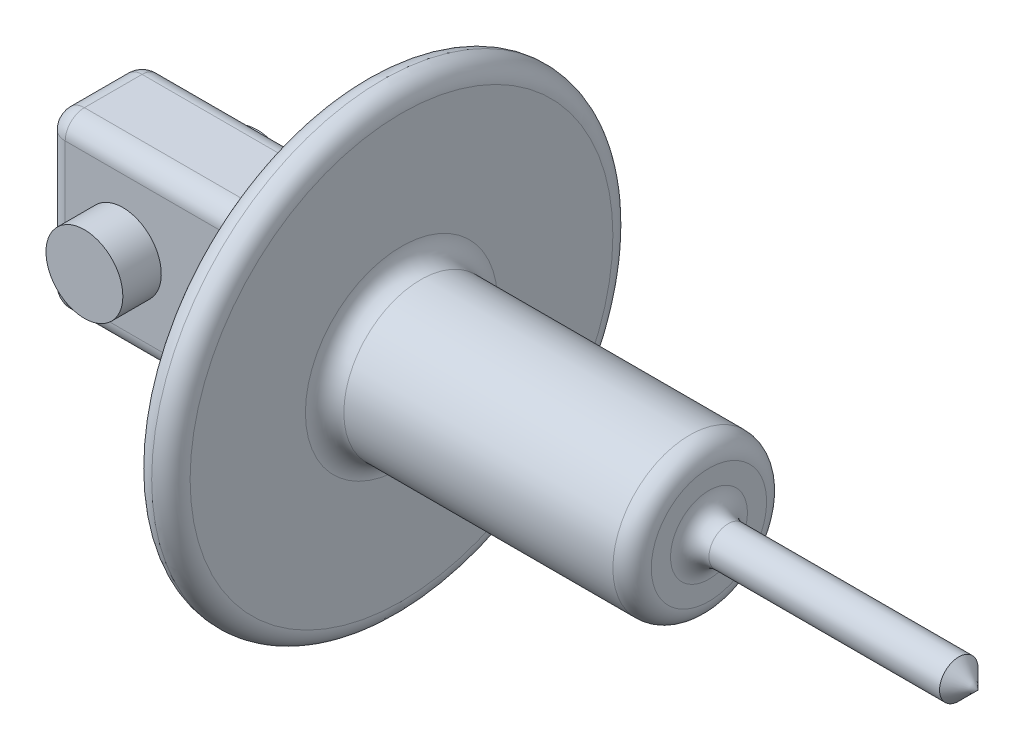
ISO-10303-21;
HEADER;
FILE_DESCRIPTION(('STEP AP214'),'2;1');
FILE_NAME('part.step','',(''),(''),'','','');
FILE_SCHEMA(('AUTOMOTIVE_DESIGN { 1 0 10303 214 1 1 1 1 }'));
ENDSEC;
DATA;
#1=APPLICATION_CONTEXT('core data for automotive mechanical design processes');
#2=APPLICATION_PROTOCOL_DEFINITION('international standard','automotive_design',2000,#1);
#3=PRODUCT_CONTEXT('',#1,'mechanical');
#4=PRODUCT('Part','Part','',(#3));
#5=PRODUCT_RELATED_PRODUCT_CATEGORY('part','',(#4));
#6=PRODUCT_DEFINITION_FORMATION('','',#4);
#7=PRODUCT_DEFINITION_CONTEXT('part definition',#1,'design');
#8=PRODUCT_DEFINITION('design','',#6,#7);
#9=PRODUCT_DEFINITION_SHAPE('','',#8);
#10=(LENGTH_UNIT() NAMED_UNIT(*) SI_UNIT(.MILLI.,.METRE.));
#11=(NAMED_UNIT(*) PLANE_ANGLE_UNIT() SI_UNIT($,.RADIAN.));
#12=(NAMED_UNIT(*) SI_UNIT($,.STERADIAN.) SOLID_ANGLE_UNIT());
#13=UNCERTAINTY_MEASURE_WITH_UNIT(LENGTH_MEASURE(1.E-05),#10,'distance_accuracy_value','');
#14=(GEOMETRIC_REPRESENTATION_CONTEXT(3) GLOBAL_UNCERTAINTY_ASSIGNED_CONTEXT((#13)) GLOBAL_UNIT_ASSIGNED_CONTEXT((#10,
#11,#12)) REPRESENTATION_CONTEXT('',''));
#15=CARTESIAN_POINT('',(0.,0.,0.));
#16=DIRECTION('',(0.,0.,1.));
#17=DIRECTION('',(1.,0.,0.));
#18=AXIS2_PLACEMENT_3D('',#15,#16,#17);
#19=CARTESIAN_POINT('',(50.,1.89429388422407E-13,0.));
#20=DIRECTION('',(-1.,0.,0.));
#21=DIRECTION('',(0.,0.,1.));
#22=AXIS2_PLACEMENT_3D('',#19,#20,#21);
#23=PLANE('',#22);
#24=CARTESIAN_POINT('',(50.,1.89429388422407E-13,0.));
#25=DIRECTION('',(-1.,0.,0.));
#26=DIRECTION('',(0.,0.,1.));
#27=AXIS2_PLACEMENT_3D('',#24,#25,#26);
#28=CIRCLE('',#27,55.);
#29=CARTESIAN_POINT('',(50.,5.73492335695152E-13,55.));
#30=VERTEX_POINT('',#29);
#31=EDGE_CURVE('E184',#30,#30,#28,.T.);
#32=ORIENTED_EDGE('',*,*,#31,.T.);
#33=EDGE_LOOP('',(#32));
#34=FACE_BOUND('',#33,.T.);
#35=CARTESIAN_POINT('',(49.9999999999999,17.5000000000002,7.49999999999985));
#36=DIRECTION('',(-1.,0.,0.));
#37=DIRECTION('',(0.,0.,1.));
#38=AXIS2_PLACEMENT_3D('',#35,#36,#37);
#39=CIRCLE('',#38,10.);
#40=CARTESIAN_POINT('',(49.9999999999999,17.5000000000003,17.4999999999999));
#41=VERTEX_POINT('',#40);
#42=CARTESIAN_POINT('',(49.9999999999998,27.5000000000002,7.49999999999978));
#43=VERTEX_POINT('',#42);
#44=EDGE_CURVE('E181',#41,#43,#39,.T.);
#45=ORIENTED_EDGE('',*,*,#44,.F.);
#46=DIRECTION('',(0.,-1.,0.));
#47=VECTOR('',#46,1.);
#48=CARTESIAN_POINT('',(50.0000000000002,-22.4999999999997,17.5000000000001));
#49=LINE('',#48,#47);
#50=CARTESIAN_POINT('',(50.0000000000001,-17.4999999999997,17.5000000000001));
#51=VERTEX_POINT('',#50);
#52=EDGE_CURVE('E178',#41,#51,#49,.T.);
#53=ORIENTED_EDGE('',*,*,#52,.T.);
#54=CARTESIAN_POINT('',(50.0000000000001,-17.4999999999998,7.5000000000001));
#55=DIRECTION('',(-1.,0.,0.));
#56=DIRECTION('',(0.,0.,1.));
#57=AXIS2_PLACEMENT_3D('',#54,#55,#56);
#58=CIRCLE('',#57,10.);
#59=CARTESIAN_POINT('',(50.0000000000002,-27.4999999999998,7.50000000000017));
#60=VERTEX_POINT('',#59);
#61=EDGE_CURVE('E175',#60,#51,#58,.T.);
#62=ORIENTED_EDGE('',*,*,#61,.F.);
#63=DIRECTION('',(0.,0.,1.));
#64=VECTOR('',#63,1.);
#65=CARTESIAN_POINT('',(50.0000000000002,-27.4999999999998,1.64275898020743E-13));
#66=LINE('',#65,#64);
#67=CARTESIAN_POINT('',(50.0000000000002,-27.4999999999999,-7.49999999999983));
#68=VERTEX_POINT('',#67);
#69=EDGE_CURVE('E171',#60,#68,#66,.F.);
#70=ORIENTED_EDGE('',*,*,#69,.T.);
#71=CARTESIAN_POINT('',(50.0000000000001,-17.4999999999999,-7.4999999999999));
#72=DIRECTION('',(-1.,0.,0.));
#73=DIRECTION('',(0.,0.,1.));
#74=AXIS2_PLACEMENT_3D('',#71,#72,#73);
#75=CIRCLE('',#74,10.);
#76=CARTESIAN_POINT('',(50.0000000000001,-17.4999999999999,-17.4999999999999));
#77=VERTEX_POINT('',#76);
#78=EDGE_CURVE('E168',#77,#68,#75,.T.);
#79=ORIENTED_EDGE('',*,*,#78,.F.);
#80=DIRECTION('',(0.,-1.,0.));
#81=VECTOR('',#80,1.);
#82=CARTESIAN_POINT('',(50.,0.,-17.5));
#83=LINE('',#82,#81);
#84=CARTESIAN_POINT('',(49.9999999999999,17.5000000000001,-17.5000000000001));
#85=VERTEX_POINT('',#84);
#86=EDGE_CURVE('E160',#77,#85,#83,.F.);
#87=ORIENTED_EDGE('',*,*,#86,.T.);
#88=CARTESIAN_POINT('',(49.9999999999999,17.5000000000001,-7.50000000000015));
#89=DIRECTION('',(-1.,0.,0.));
#90=DIRECTION('',(0.,0.,1.));
#91=AXIS2_PLACEMENT_3D('',#88,#89,#90);
#92=CIRCLE('',#91,10.);
#93=CARTESIAN_POINT('',(49.9999999999998,27.5000000000001,-7.50000000000022));
#94=VERTEX_POINT('',#93);
#95=EDGE_CURVE('E156',#94,#85,#92,.T.);
#96=ORIENTED_EDGE('',*,*,#95,.F.);
#97=DIRECTION('',(0.,0.,1.));
#98=VECTOR('',#97,1.);
#99=CARTESIAN_POINT('',(49.9999999999998,27.5000000000003,12.4999999999998));
#100=LINE('',#99,#98);
#101=EDGE_CURVE('E173',#94,#43,#100,.T.);
#102=ORIENTED_EDGE('',*,*,#101,.T.);
#103=EDGE_LOOP('',(#45,#53,#62,#70,#79,#87,#96,#102));
#104=FACE_BOUND('',#103,.T.);
#105=ADVANCED_FACE('F40',(#34,#104),#23,.T.);
#106=CARTESIAN_POINT('',(60.,2.5925901519927E-13,0.));
#107=DIRECTION('',(-1.,0.,0.));
#108=DIRECTION('',(0.,0.,1.));
#109=AXIS2_PLACEMENT_3D('',#106,#107,#108);
#110=PLANE('',#109);
#111=CARTESIAN_POINT('',(60.,2.5925901519927E-13,0.));
#112=DIRECTION('',(-1.,0.,0.));
#113=DIRECTION('',(0.,0.,1.));
#114=AXIS2_PLACEMENT_3D('',#111,#112,#113);
#115=CIRCLE('',#114,25.);
#116=CARTESIAN_POINT('',(60.,4.33833082141426E-13,25.));
#117=VERTEX_POINT('',#116);
#118=EDGE_CURVE('E217',#117,#117,#115,.T.);
#119=ORIENTED_EDGE('',*,*,#118,.T.);
#120=EDGE_LOOP('',(#119));
#121=FACE_BOUND('',#120,.T.);
#122=CARTESIAN_POINT('',(60.,2.5925901519927E-13,0.));
#123=DIRECTION('',(-1.,0.,0.));
#124=DIRECTION('',(0.,0.,1.));
#125=AXIS2_PLACEMENT_3D('',#122,#123,#124);
#126=CIRCLE('',#125,55.);
#127=CARTESIAN_POINT('',(60.,6.43321962472014E-13,55.));
#128=VERTEX_POINT('',#127);
#129=EDGE_CURVE('E214',#128,#128,#126,.F.);
#130=ORIENTED_EDGE('',*,*,#129,.T.);
#131=EDGE_LOOP('',(#130));
#132=FACE_BOUND('',#131,.T.);
#133=ADVANCED_FACE('F345',(#121,#132),#110,.F.);
#134=CARTESIAN_POINT('',(140.,8.17896029414171E-13,0.));
#135=DIRECTION('',(-1.,0.,0.));
#136=DIRECTION('',(0.,0.,1.));
#137=AXIS2_PLACEMENT_3D('',#134,#135,#136);
#138=CYLINDRICAL_SURFACE('',#137,20.);
#139=CARTESIAN_POINT('',(65.,2.94173828587701E-13,0.));
#140=DIRECTION('',(-1.,0.,0.));
#141=DIRECTION('',(0.,0.,1.));
#142=AXIS2_PLACEMENT_3D('',#139,#140,#141);
#143=CIRCLE('',#142,20.);
#144=CARTESIAN_POINT('',(65.,4.33833082141427E-13,20.));
#145=VERTEX_POINT('',#144);
#146=EDGE_CURVE('E223',#145,#145,#143,.F.);
#147=ORIENTED_EDGE('',*,*,#146,.T.);
#148=EDGE_LOOP('',(#147));
#149=FACE_BOUND('',#148,.T.);
#150=CARTESIAN_POINT('',(135.,7.8298121602574E-13,0.));
#151=DIRECTION('',(-1.,0.,0.));
#152=DIRECTION('',(0.,0.,1.));
#153=AXIS2_PLACEMENT_3D('',#150,#151,#152);
#154=CIRCLE('',#153,20.);
#155=CARTESIAN_POINT('',(135.,9.22640469579465E-13,20.));
#156=VERTEX_POINT('',#155);
#157=EDGE_CURVE('E220',#156,#156,#154,.T.);
#158=ORIENTED_EDGE('',*,*,#157,.T.);
#159=EDGE_LOOP('',(#158));
#160=FACE_BOUND('',#159,.T.);
#161=ADVANCED_FACE('F351',(#149,#160),#138,.T.);
#162=CARTESIAN_POINT('',(140.,8.17896029414171E-13,0.));
#163=DIRECTION('',(-1.,0.,0.));
#164=DIRECTION('',(0.,0.,1.));
#165=AXIS2_PLACEMENT_3D('',#162,#163,#164);
#166=PLANE('',#165);
#167=CARTESIAN_POINT('',(140.,8.17896029414171E-13,0.));
#168=DIRECTION('',(-1.,0.,0.));
#169=DIRECTION('',(0.,0.,1.));
#170=AXIS2_PLACEMENT_3D('',#167,#168,#169);
#171=CIRCLE('',#170,10.);
#172=CARTESIAN_POINT('',(140.,8.87725656191034E-13,9.99999999999997));
#173=VERTEX_POINT('',#172);
#174=EDGE_CURVE('E229',#173,#173,#171,.T.);
#175=ORIENTED_EDGE('',*,*,#174,.T.);
#176=EDGE_LOOP('',(#175));
#177=FACE_BOUND('',#176,.T.);
#178=CARTESIAN_POINT('',(140.,8.17896029414171E-13,0.));
#179=DIRECTION('',(-1.,0.,0.));
#180=DIRECTION('',(0.,0.,1.));
#181=AXIS2_PLACEMENT_3D('',#178,#179,#180);
#182=CIRCLE('',#181,15.);
#183=CARTESIAN_POINT('',(140.,9.22640469579465E-13,15.));
#184=VERTEX_POINT('',#183);
#185=EDGE_CURVE('E226',#184,#184,#182,.F.);
#186=ORIENTED_EDGE('',*,*,#185,.T.);
#187=EDGE_LOOP('',(#186));
#188=FACE_BOUND('',#187,.T.);
#189=ADVANCED_FACE('F670',(#177,#188),#166,.F.);
#190=CARTESIAN_POINT('',(210.,1.30670341685221E-12,0.));
#191=DIRECTION('',(-1.,0.,0.));
#192=DIRECTION('',(0.,0.,1.));
#193=AXIS2_PLACEMENT_3D('',#190,#191,#192);
#194=CYLINDRICAL_SURFACE('',#193,5.);
#195=CARTESIAN_POINT('',(145.,8.52810842802602E-13,0.));
#196=DIRECTION('',(-1.,0.,0.));
#197=DIRECTION('',(0.,0.,1.));
#198=AXIS2_PLACEMENT_3D('',#195,#196,#197);
#199=CIRCLE('',#198,5.);
#200=CARTESIAN_POINT('',(145.,8.87725656191034E-13,4.99999999999997));
#201=VERTEX_POINT('',#200);
#202=EDGE_CURVE('E232',#201,#201,#199,.F.);
#203=ORIENTED_EDGE('',*,*,#202,.T.);
#204=EDGE_LOOP('',(#203));
#205=FACE_BOUND('',#204,.T.);
#206=CARTESIAN_POINT('',(205.,1.27178860346378E-12,0.));
#207=DIRECTION('',(-1.,0.,0.));
#208=DIRECTION('',(0.,0.,1.));
#209=AXIS2_PLACEMENT_3D('',#206,#207,#208);
#210=CIRCLE('',#209,5.);
#211=CARTESIAN_POINT('',(205.,1.30670341685221E-12,4.99999999999997));
#212=VERTEX_POINT('',#211);
#213=EDGE_CURVE('E154',#212,#212,#210,.T.);
#214=ORIENTED_EDGE('',*,*,#213,.T.);
#215=EDGE_LOOP('',(#214));
#216=FACE_BOUND('',#215,.T.);
#217=ADVANCED_FACE('F150',(#205,#216),#194,.T.);
#218=CARTESIAN_POINT('',(205.,1.27178860346378E-12,0.));
#219=DIRECTION('',(-1.,0.,0.));
#220=DIRECTION('',(0.,0.,1.));
#221=AXIS2_PLACEMENT_3D('',#218,#219,#220);
#222=CONICAL_SURFACE('',#221,4.99999999999997,0.785398163397451);
#223=CARTESIAN_POINT('',(210.,1.30670341685221E-12,0.));
#224=VERTEX_POINT('',#223);
#225=VERTEX_LOOP('',#224);
#226=FACE_BOUND('',#225,.T.);
#227=ORIENTED_EDGE('',*,*,#213,.F.);
#228=EDGE_LOOP('',(#227));
#229=FACE_BOUND('',#228,.T.);
#230=ADVANCED_FACE('F146',(#226,#229),#222,.T.);
#231=CARTESIAN_POINT('',(-20.0000000000002,22.4999999999996,-12.5000000000002));
#232=DIRECTION('',(0.,0.,1.));
#233=DIRECTION('',(0.,1.,0.));
#234=AXIS2_PLACEMENT_3D('',#231,#232,#233);
#235=PLANE('',#234);
#236=DIRECTION('',(1.,0.,0.));
#237=VECTOR('',#236,1.);
#238=CARTESIAN_POINT('',(49.9999999999999,17.5000000000001,-12.5000000000001));
#239=LINE('',#238,#237);
#240=CARTESIAN_POINT('',(-15.0000000000001,17.4999999999996,-12.5000000000001));
#241=VERTEX_POINT('',#240);
#242=CARTESIAN_POINT('',(44.9999999999999,17.5000000000001,-12.5000000000001));
#243=VERTEX_POINT('',#242);
#244=EDGE_CURVE('E235',#241,#243,#239,.T.);
#245=ORIENTED_EDGE('',*,*,#244,.T.);
#246=DIRECTION('',(0.,-1.,0.));
#247=VECTOR('',#246,1.);
#248=CARTESIAN_POINT('',(44.9999999999998,22.5000000000001,-12.5000000000002));
#249=LINE('',#248,#247);
#250=CARTESIAN_POINT('',(45.0000000000001,-17.4999999999999,-12.4999999999999));
#251=VERTEX_POINT('',#250);
#252=EDGE_CURVE('E241',#243,#251,#249,.T.);
#253=ORIENTED_EDGE('',*,*,#252,.T.);
#254=DIRECTION('',(1.,0.,0.));
#255=VECTOR('',#254,1.);
#256=CARTESIAN_POINT('',(-19.9999999999999,-17.5000000000004,-12.4999999999999));
#257=LINE('',#256,#255);
#258=CARTESIAN_POINT('',(-14.9999999999999,-17.5000000000004,-12.4999999999999));
#259=VERTEX_POINT('',#258);
#260=EDGE_CURVE('E239',#251,#259,#257,.F.);
#261=ORIENTED_EDGE('',*,*,#260,.T.);
#262=DIRECTION('',(0.,-1.,0.));
#263=VECTOR('',#262,1.);
#264=CARTESIAN_POINT('',(-15.0000000000002,22.4999999999996,-12.5000000000002));
#265=LINE('',#264,#263);
#266=EDGE_CURVE('E237',#259,#241,#265,.F.);
#267=ORIENTED_EDGE('',*,*,#266,.T.);
#268=EDGE_LOOP('',(#245,#253,#261,#267));
#269=FACE_BOUND('',#268,.T.);
#270=CARTESIAN_POINT('',(0.,-2.45560176036337E-13,-12.5));
#271=DIRECTION('',(0.,0.,1.));
#272=DIRECTION('',(0.,1.,0.));
#273=AXIS2_PLACEMENT_3D('',#270,#271,#272);
#274=CIRCLE('',#273,10.);
#275=CARTESIAN_POINT('',(0.,9.99999999999975,-12.5000000000001));
#276=VERTEX_POINT('',#275);
#277=EDGE_CURVE('E310',#276,#276,#274,.T.);
#278=ORIENTED_EDGE('',*,*,#277,.T.);
#279=EDGE_LOOP('',(#278));
#280=FACE_BOUND('',#279,.T.);
#281=ADVANCED_FACE('F149',(#269,#280),#235,.F.);
#282=CARTESIAN_POINT('',(-19.9999999999999,-22.5000000000004,-12.4999999999999));
#283=DIRECTION('',(0.,1.,0.));
#284=DIRECTION('',(0.,0.,-1.));
#285=AXIS2_PLACEMENT_3D('',#282,#283,#284);
#286=PLANE('',#285);
#287=DIRECTION('',(1.,0.,0.));
#288=VECTOR('',#287,1.);
#289=CARTESIAN_POINT('',(-19.9999999999999,-22.5000000000004,-7.49999999999987));
#290=LINE('',#289,#288);
#291=CARTESIAN_POINT('',(-14.9999999999998,-22.5000000000003,-7.49999999999987));
#292=VERTEX_POINT('',#291);
#293=CARTESIAN_POINT('',(45.0000000000001,-22.4999999999999,-7.49999999999987));
#294=VERTEX_POINT('',#293);
#295=EDGE_CURVE('E207',#292,#294,#290,.T.);
#296=ORIENTED_EDGE('',*,*,#295,.T.);
#297=DIRECTION('',(0.,0.,1.));
#298=VECTOR('',#297,1.);
#299=CARTESIAN_POINT('',(45.0000000000001,-22.4999999999999,-12.4999999999999));
#300=LINE('',#299,#298);
#301=CARTESIAN_POINT('',(45.0000000000001,-22.4999999999998,7.50000000000013));
#302=VERTEX_POINT('',#301);
#303=EDGE_CURVE('E211',#294,#302,#300,.T.);
#304=ORIENTED_EDGE('',*,*,#303,.T.);
#305=DIRECTION('',(1.,0.,0.));
#306=VECTOR('',#305,1.);
#307=CARTESIAN_POINT('',(-19.9999999999999,-22.5000000000003,7.50000000000013));
#308=LINE('',#307,#306);
#309=CARTESIAN_POINT('',(-14.9999999999998,-22.5000000000002,7.50000000000013));
#310=VERTEX_POINT('',#309);
#311=EDGE_CURVE('E209',#302,#310,#308,.F.);
#312=ORIENTED_EDGE('',*,*,#311,.T.);
#313=DIRECTION('',(0.,0.,1.));
#314=VECTOR('',#313,1.);
#315=CARTESIAN_POINT('',(-14.9999999999998,-22.5000000000004,-12.4999999999999));
#316=LINE('',#315,#314);
#317=EDGE_CURVE('E205',#310,#292,#316,.F.);
#318=ORIENTED_EDGE('',*,*,#317,.T.);
#319=EDGE_LOOP('',(#296,#304,#312,#318));
#320=FACE_BOUND('',#319,.T.);
#321=ADVANCED_FACE('F332',(#320),#286,.F.);
#322=CARTESIAN_POINT('',(-20.0000000000002,22.4999999999998,12.4999999999998));
#323=DIRECTION('',(0.,0.,1.));
#324=DIRECTION('',(0.,1.,0.));
#325=AXIS2_PLACEMENT_3D('',#322,#323,#324);
#326=PLANE('',#325);
#327=DIRECTION('',(1.,0.,0.));
#328=VECTOR('',#327,1.);
#329=CARTESIAN_POINT('',(50.0000000000001,-17.4999999999997,12.5000000000001));
#330=LINE('',#329,#328);
#331=CARTESIAN_POINT('',(-14.9999999999999,-17.5000000000002,12.5000000000001));
#332=VERTEX_POINT('',#331);
#333=CARTESIAN_POINT('',(45.0000000000001,-17.4999999999998,12.5000000000001));
#334=VERTEX_POINT('',#333);
#335=EDGE_CURVE('E191',#332,#334,#330,.T.);
#336=ORIENTED_EDGE('',*,*,#335,.T.);
#337=DIRECTION('',(0.,-1.,0.));
#338=VECTOR('',#337,1.);
#339=CARTESIAN_POINT('',(44.9999999999998,22.5000000000002,12.4999999999998));
#340=LINE('',#339,#338);
#341=CARTESIAN_POINT('',(44.9999999999999,17.5000000000002,12.4999999999999));
#342=VERTEX_POINT('',#341);
#343=EDGE_CURVE('E193',#334,#342,#340,.F.);
#344=ORIENTED_EDGE('',*,*,#343,.T.);
#345=DIRECTION('',(1.,0.,0.));
#346=VECTOR('',#345,1.);
#347=CARTESIAN_POINT('',(-20.0000000000001,17.4999999999998,12.4999999999999));
#348=LINE('',#347,#346);
#349=CARTESIAN_POINT('',(-15.0000000000001,17.4999999999998,12.4999999999999));
#350=VERTEX_POINT('',#349);
#351=EDGE_CURVE('E187',#342,#350,#348,.F.);
#352=ORIENTED_EDGE('',*,*,#351,.T.);
#353=DIRECTION('',(0.,-1.,0.));
#354=VECTOR('',#353,1.);
#355=CARTESIAN_POINT('',(-15.0000000000002,22.4999999999998,12.4999999999998));
#356=LINE('',#355,#354);
#357=EDGE_CURVE('E189',#350,#332,#356,.T.);
#358=ORIENTED_EDGE('',*,*,#357,.T.);
#359=EDGE_LOOP('',(#336,#344,#352,#358));
#360=FACE_BOUND('',#359,.T.);
#361=CARTESIAN_POINT('',(0.,0.,12.5));
#362=DIRECTION('',(0.,0.,1.));
#363=DIRECTION('',(0.,1.,0.));
#364=AXIS2_PLACEMENT_3D('',#361,#362,#363);
#365=CIRCLE('',#364,10.);
#366=CARTESIAN_POINT('',(0.,9.99999999999993,12.4999999999999));
#367=VERTEX_POINT('',#366);
#368=EDGE_CURVE('E163',#367,#367,#365,.T.);
#369=ORIENTED_EDGE('',*,*,#368,.F.);
#370=EDGE_LOOP('',(#369));
#371=FACE_BOUND('',#370,.T.);
#372=ADVANCED_FACE('F329',(#360,#371),#326,.T.);
#373=CARTESIAN_POINT('',(-20.0000000000002,22.4999999999996,-12.5000000000002));
#374=DIRECTION('',(0.,1.,0.));
#375=DIRECTION('',(0.,0.,-1.));
#376=AXIS2_PLACEMENT_3D('',#373,#374,#375);
#377=PLANE('',#376);
#378=DIRECTION('',(1.,0.,0.));
#379=VECTOR('',#378,1.);
#380=CARTESIAN_POINT('',(-20.0000000000002,22.4999999999997,7.49999999999982));
#381=LINE('',#380,#379);
#382=CARTESIAN_POINT('',(-15.0000000000002,22.4999999999998,7.49999999999982));
#383=VERTEX_POINT('',#382);
#384=CARTESIAN_POINT('',(44.9999999999998,22.5000000000002,7.49999999999982));
#385=VERTEX_POINT('',#384);
#386=EDGE_CURVE('E200',#383,#385,#381,.T.);
#387=ORIENTED_EDGE('',*,*,#386,.T.);
#388=DIRECTION('',(0.,0.,1.));
#389=VECTOR('',#388,1.);
#390=CARTESIAN_POINT('',(44.9999999999998,22.5000000000001,-12.5000000000002));
#391=LINE('',#390,#389);
#392=CARTESIAN_POINT('',(44.9999999999998,22.5000000000001,-7.50000000000018));
#393=VERTEX_POINT('',#392);
#394=EDGE_CURVE('E202',#385,#393,#391,.F.);
#395=ORIENTED_EDGE('',*,*,#394,.T.);
#396=DIRECTION('',(1.,0.,0.));
#397=VECTOR('',#396,1.);
#398=CARTESIAN_POINT('',(-20.0000000000002,22.4999999999996,-7.50000000000018));
#399=LINE('',#398,#397);
#400=CARTESIAN_POINT('',(-15.0000000000002,22.4999999999997,-7.50000000000018));
#401=VERTEX_POINT('',#400);
#402=EDGE_CURVE('E196',#393,#401,#399,.F.);
#403=ORIENTED_EDGE('',*,*,#402,.T.);
#404=DIRECTION('',(0.,0.,1.));
#405=VECTOR('',#404,1.);
#406=CARTESIAN_POINT('',(-15.0000000000002,22.4999999999996,-12.5000000000002));
#407=LINE('',#406,#405);
#408=EDGE_CURVE('E198',#401,#383,#407,.T.);
#409=ORIENTED_EDGE('',*,*,#408,.T.);
#410=EDGE_LOOP('',(#387,#395,#403,#409));
#411=FACE_BOUND('',#410,.T.);
#412=ADVANCED_FACE('F331',(#411),#377,.T.);
#413=CARTESIAN_POINT('',(-20.,-2.99377999015632E-13,0.));
#414=DIRECTION('',(-1.,0.,0.));
#415=DIRECTION('',(0.,0.,1.));
#416=AXIS2_PLACEMENT_3D('',#413,#414,#415);
#417=PLANE('',#416);
#418=DIRECTION('',(0.,-1.,0.));
#419=VECTOR('',#418,1.);
#420=CARTESIAN_POINT('',(-19.9999999999999,-22.5000000000004,-7.49999999999987));
#421=LINE('',#420,#419);
#422=CARTESIAN_POINT('',(-20.0000000000001,17.4999999999996,-7.50000000000015));
#423=VERTEX_POINT('',#422);
#424=CARTESIAN_POINT('',(-19.9999999999999,-17.5000000000004,-7.4999999999999));
#425=VERTEX_POINT('',#424);
#426=EDGE_CURVE('E64',#423,#425,#421,.T.);
#427=ORIENTED_EDGE('',*,*,#426,.T.);
#428=DIRECTION('',(0.,0.,1.));
#429=VECTOR('',#428,1.);
#430=CARTESIAN_POINT('',(-19.9999999999999,-17.5000000000002,12.5000000000001));
#431=LINE('',#430,#429);
#432=CARTESIAN_POINT('',(-19.9999999999999,-17.5000000000003,7.5000000000001));
#433=VERTEX_POINT('',#432);
#434=EDGE_CURVE('E11',#425,#433,#431,.T.);
#435=ORIENTED_EDGE('',*,*,#434,.T.);
#436=DIRECTION('',(0.,-1.,0.));
#437=VECTOR('',#436,1.);
#438=CARTESIAN_POINT('',(-20.,-2.46138417194996E-13,7.49999999999998));
#439=LINE('',#438,#437);
#440=CARTESIAN_POINT('',(-20.0000000000001,17.4999999999997,7.49999999999985));
#441=VERTEX_POINT('',#440);
#442=EDGE_CURVE('E49',#433,#441,#439,.F.);
#443=ORIENTED_EDGE('',*,*,#442,.T.);
#444=DIRECTION('',(0.,0.,1.));
#445=VECTOR('',#444,1.);
#446=CARTESIAN_POINT('',(-20.0000000000001,17.4999999999997,-1.49957422475139E-13));
#447=LINE('',#446,#445);
#448=EDGE_CURVE('E244',#441,#423,#447,.F.);
#449=ORIENTED_EDGE('',*,*,#448,.T.);
#450=EDGE_LOOP('',(#427,#435,#443,#449));
#451=FACE_BOUND('',#450,.T.);
#452=ADVANCED_FACE('F339',(#451),#417,.T.);
#453=CARTESIAN_POINT('',(0.,0.,22.5));
#454=DIRECTION('',(0.,0.,-1.));
#455=DIRECTION('',(0.,-1.,0.));
#456=AXIS2_PLACEMENT_3D('',#453,#454,#455);
#457=CYLINDRICAL_SURFACE('',#456,10.);
#458=CARTESIAN_POINT('',(0.,0.,22.5));
#459=DIRECTION('',(0.,0.,1.));
#460=DIRECTION('',(0.,1.,0.));
#461=AXIS2_PLACEMENT_3D('',#458,#459,#460);
#462=CIRCLE('',#461,10.);
#463=CARTESIAN_POINT('',(0.,10.,22.4999999999999));
#464=VERTEX_POINT('',#463);
#465=EDGE_CURVE('E157',#464,#464,#462,.T.);
#466=ORIENTED_EDGE('',*,*,#465,.F.);
#467=EDGE_LOOP('',(#466));
#468=FACE_BOUND('',#467,.T.);
#469=ORIENTED_EDGE('',*,*,#368,.T.);
#470=EDGE_LOOP('',(#469));
#471=FACE_BOUND('',#470,.T.);
#472=ADVANCED_FACE('F327',(#468,#471),#457,.T.);
#473=CARTESIAN_POINT('',(0.,0.,22.5));
#474=DIRECTION('',(0.,0.,1.));
#475=DIRECTION('',(0.,1.,0.));
#476=AXIS2_PLACEMENT_3D('',#473,#474,#475);
#477=PLANE('',#476);
#478=ORIENTED_EDGE('',*,*,#465,.T.);
#479=EDGE_LOOP('',(#478));
#480=FACE_BOUND('',#479,.T.);
#481=ADVANCED_FACE('F596',(#480),#477,.T.);
#482=CARTESIAN_POINT('',(0.,-3.14233320495882E-13,-22.5));
#483=DIRECTION('',(0.,0.,1.));
#484=DIRECTION('',(0.,1.,0.));
#485=AXIS2_PLACEMENT_3D('',#482,#483,#484);
#486=CYLINDRICAL_SURFACE('',#485,10.);
#487=CARTESIAN_POINT('',(0.,-3.14233320495882E-13,-22.5));
#488=DIRECTION('',(0.,0.,1.));
#489=DIRECTION('',(0.,1.,0.));
#490=AXIS2_PLACEMENT_3D('',#487,#488,#489);
#491=CIRCLE('',#490,10.);
#492=CARTESIAN_POINT('',(0.,9.99999999999969,-22.5000000000001));
#493=VERTEX_POINT('',#492);
#494=EDGE_CURVE('E316',#493,#493,#491,.T.);
#495=ORIENTED_EDGE('',*,*,#494,.T.);
#496=EDGE_LOOP('',(#495));
#497=FACE_BOUND('',#496,.T.);
#498=ORIENTED_EDGE('',*,*,#277,.F.);
#499=EDGE_LOOP('',(#498));
#500=FACE_BOUND('',#499,.T.);
#501=ADVANCED_FACE('F587',(#497,#500),#486,.T.);
#502=CARTESIAN_POINT('',(0.,-3.14233320495882E-13,-22.5));
#503=DIRECTION('',(0.,0.,-1.));
#504=DIRECTION('',(0.,1.,0.));
#505=AXIS2_PLACEMENT_3D('',#502,#503,#504);
#506=PLANE('',#505);
#507=ORIENTED_EDGE('',*,*,#494,.F.);
#508=EDGE_LOOP('',(#507));
#509=FACE_BOUND('',#508,.T.);
#510=ADVANCED_FACE('F436',(#509),#506,.T.);
#511=CARTESIAN_POINT('',(-15.,-3.17702767447836E-13,-7.50000000000003));
#512=DIRECTION('',(0.,1.,0.));
#513=DIRECTION('',(0.,0.,-1.));
#514=AXIS2_PLACEMENT_3D('',#511,#512,#513);
#515=CYLINDRICAL_SURFACE('',#514,5.);
#516=CARTESIAN_POINT('',(-15.0000000000001,17.4999999999997,-7.50000000000015));
#517=DIRECTION('',(0.,1.,0.));
#518=DIRECTION('',(0.,0.,-1.));
#519=AXIS2_PLACEMENT_3D('',#516,#517,#518);
#520=CIRCLE('',#519,5.);
#521=EDGE_CURVE('E308',#241,#423,#520,.T.);
#522=ORIENTED_EDGE('',*,*,#521,.F.);
#523=ORIENTED_EDGE('',*,*,#266,.F.);
#524=CARTESIAN_POINT('',(-14.9999999999999,-17.5000000000003,-7.4999999999999));
#525=DIRECTION('',(0.,-1.,0.));
#526=DIRECTION('',(0.,0.,1.));
#527=AXIS2_PLACEMENT_3D('',#524,#525,#526);
#528=CIRCLE('',#527,5.);
#529=EDGE_CURVE('E306',#425,#259,#528,.T.);
#530=ORIENTED_EDGE('',*,*,#529,.F.);
#531=ORIENTED_EDGE('',*,*,#426,.F.);
#532=EDGE_LOOP('',(#522,#523,#530,#531));
#533=FACE_BOUND('',#532,.T.);
#534=ADVANCED_FACE('F433',(#533),#515,.T.);
#535=CARTESIAN_POINT('',(-15.0000000000001,17.4999999999997,-7.50000000000015));
#536=DIRECTION('',(0.,0.,-1.));
#537=DIRECTION('',(-1.,0.,0.));
#538=AXIS2_PLACEMENT_3D('',#535,#536,#537);
#539=SPHERICAL_SURFACE('',#538,5.);
#540=CARTESIAN_POINT('',(-15.0000000000001,17.4999999999997,-7.50000000000015));
#541=DIRECTION('',(-1.,0.,0.));
#542=DIRECTION('',(0.,0.,1.));
#543=AXIS2_PLACEMENT_3D('',#540,#541,#542);
#544=CIRCLE('',#543,5.);
#545=EDGE_CURVE('E300',#241,#401,#544,.F.);
#546=ORIENTED_EDGE('',*,*,#545,.F.);
#547=ORIENTED_EDGE('',*,*,#521,.T.);
#548=CARTESIAN_POINT('',(-15.0000000000001,17.4999999999997,-7.50000000000015));
#549=DIRECTION('',(0.,0.,-1.));
#550=DIRECTION('',(-1.,0.,0.));
#551=AXIS2_PLACEMENT_3D('',#548,#549,#550);
#552=CIRCLE('',#551,5.);
#553=EDGE_CURVE('E303',#401,#423,#552,.F.);
#554=ORIENTED_EDGE('',*,*,#553,.F.);
#555=EDGE_LOOP('',(#546,#547,#554));
#556=FACE_BOUND('',#555,.T.);
#557=ADVANCED_FACE('F429',(#556),#539,.T.);
#558=CARTESIAN_POINT('',(-14.9999999999999,-17.5000000000003,-7.4999999999999));
#559=DIRECTION('',(0.,0.,-1.));
#560=DIRECTION('',(-1.,0.,0.));
#561=AXIS2_PLACEMENT_3D('',#558,#559,#560);
#562=SPHERICAL_SURFACE('',#561,5.);
#563=CARTESIAN_POINT('',(-14.9999999999999,-17.5000000000003,-7.4999999999999));
#564=DIRECTION('',(0.,0.,-1.));
#565=DIRECTION('',(-1.,0.,0.));
#566=AXIS2_PLACEMENT_3D('',#563,#564,#565);
#567=CIRCLE('',#566,5.);
#568=EDGE_CURVE('E294',#425,#292,#567,.F.);
#569=ORIENTED_EDGE('',*,*,#568,.F.);
#570=ORIENTED_EDGE('',*,*,#529,.T.);
#571=CARTESIAN_POINT('',(-14.9999999999999,-17.5000000000003,-7.4999999999999));
#572=DIRECTION('',(-1.,0.,0.));
#573=DIRECTION('',(0.,0.,1.));
#574=AXIS2_PLACEMENT_3D('',#571,#572,#573);
#575=CIRCLE('',#574,5.);
#576=EDGE_CURVE('E297',#292,#259,#575,.F.);
#577=ORIENTED_EDGE('',*,*,#576,.F.);
#578=EDGE_LOOP('',(#569,#570,#577));
#579=FACE_BOUND('',#578,.T.);
#580=ADVANCED_FACE('F425',(#579),#562,.T.);
#581=CARTESIAN_POINT('',(-15.0000000000001,17.4999999999996,-12.5000000000001));
#582=DIRECTION('',(0.,0.,1.));
#583=DIRECTION('',(1.,0.,0.));
#584=AXIS2_PLACEMENT_3D('',#581,#582,#583);
#585=CYLINDRICAL_SURFACE('',#584,5.);
#586=ORIENTED_EDGE('',*,*,#553,.T.);
#587=ORIENTED_EDGE('',*,*,#448,.F.);
#588=CARTESIAN_POINT('',(-15.0000000000001,17.4999999999998,7.49999999999985));
#589=DIRECTION('',(0.,0.,1.));
#590=DIRECTION('',(1.,0.,0.));
#591=AXIS2_PLACEMENT_3D('',#588,#589,#590);
#592=CIRCLE('',#591,5.);
#593=EDGE_CURVE('E288',#383,#441,#592,.T.);
#594=ORIENTED_EDGE('',*,*,#593,.F.);
#595=ORIENTED_EDGE('',*,*,#408,.F.);
#596=EDGE_LOOP('',(#586,#587,#594,#595));
#597=FACE_BOUND('',#596,.T.);
#598=ADVANCED_FACE('F421',(#597),#585,.T.);
#599=CARTESIAN_POINT('',(-20.0000000000001,17.4999999999996,-7.50000000000015));
#600=DIRECTION('',(-1.,0.,0.));
#601=DIRECTION('',(0.,0.,1.));
#602=AXIS2_PLACEMENT_3D('',#599,#600,#601);
#603=CYLINDRICAL_SURFACE('',#602,5.);
#604=ORIENTED_EDGE('',*,*,#545,.T.);
#605=ORIENTED_EDGE('',*,*,#402,.F.);
#606=CARTESIAN_POINT('',(44.9999999999999,17.5000000000001,-7.50000000000015));
#607=DIRECTION('',(-1.,0.,0.));
#608=DIRECTION('',(0.,0.,1.));
#609=AXIS2_PLACEMENT_3D('',#606,#607,#608);
#610=CIRCLE('',#609,5.);
#611=EDGE_CURVE('E285',#243,#393,#610,.F.);
#612=ORIENTED_EDGE('',*,*,#611,.F.);
#613=ORIENTED_EDGE('',*,*,#244,.F.);
#614=EDGE_LOOP('',(#604,#605,#612,#613));
#615=FACE_BOUND('',#614,.T.);
#616=ADVANCED_FACE('F417',(#615),#603,.T.);
#617=CARTESIAN_POINT('',(44.9999999999998,22.5,-17.5000000000002));
#618=DIRECTION('',(0.,-1.,0.));
#619=DIRECTION('',(0.,0.,1.));
#620=AXIS2_PLACEMENT_3D('',#617,#618,#619);
#621=CYLINDRICAL_SURFACE('',#620,5.);
#622=CARTESIAN_POINT('',(45.0000000000001,-17.5,-17.4999999999999));
#623=DIRECTION('',(0.,1.,0.));
#624=DIRECTION('',(0.,0.,-1.));
#625=AXIS2_PLACEMENT_3D('',#622,#623,#624);
#626=CIRCLE('',#625,5.);
#627=EDGE_CURVE('E279',#251,#77,#626,.T.);
#628=ORIENTED_EDGE('',*,*,#627,.F.);
#629=ORIENTED_EDGE('',*,*,#252,.F.);
#630=CARTESIAN_POINT('',(44.9999999999999,17.5,-17.5000000000001));
#631=DIRECTION('',(0.,-1.,0.));
#632=DIRECTION('',(0.,0.,1.));
#633=AXIS2_PLACEMENT_3D('',#630,#631,#632);
#634=CIRCLE('',#633,5.);
#635=EDGE_CURVE('E282',#85,#243,#634,.T.);
#636=ORIENTED_EDGE('',*,*,#635,.F.);
#637=ORIENTED_EDGE('',*,*,#86,.F.);
#638=EDGE_LOOP('',(#628,#629,#636,#637));
#639=FACE_BOUND('',#638,.T.);
#640=ADVANCED_FACE('F413',(#639),#621,.F.);
#641=CARTESIAN_POINT('',(-19.9999999999999,-17.5000000000004,-7.4999999999999));
#642=DIRECTION('',(1.,0.,0.));
#643=DIRECTION('',(0.,0.,-1.));
#644=AXIS2_PLACEMENT_3D('',#641,#642,#643);
#645=CYLINDRICAL_SURFACE('',#644,5.);
#646=ORIENTED_EDGE('',*,*,#576,.T.);
#647=ORIENTED_EDGE('',*,*,#260,.F.);
#648=CARTESIAN_POINT('',(45.0000000000001,-17.4999999999999,-7.4999999999999));
#649=DIRECTION('',(-1.,0.,0.));
#650=DIRECTION('',(0.,0.,1.));
#651=AXIS2_PLACEMENT_3D('',#648,#649,#650);
#652=CIRCLE('',#651,5.);
#653=EDGE_CURVE('E277',#294,#251,#652,.F.);
#654=ORIENTED_EDGE('',*,*,#653,.F.);
#655=ORIENTED_EDGE('',*,*,#295,.F.);
#656=EDGE_LOOP('',(#646,#647,#654,#655));
#657=FACE_BOUND('',#656,.T.);
#658=ADVANCED_FACE('F409',(#657),#645,.T.);
#659=CARTESIAN_POINT('',(-14.9999999999999,-17.5000000000003,0.));
#660=DIRECTION('',(0.,0.,-1.));
#661=DIRECTION('',(-1.,0.,0.));
#662=AXIS2_PLACEMENT_3D('',#659,#660,#661);
#663=CYLINDRICAL_SURFACE('',#662,5.);
#664=ORIENTED_EDGE('',*,*,#568,.T.);
#665=ORIENTED_EDGE('',*,*,#317,.F.);
#666=CARTESIAN_POINT('',(-14.9999999999999,-17.5000000000002,7.5000000000001));
#667=DIRECTION('',(0.,0.,1.));
#668=DIRECTION('',(1.,0.,0.));
#669=AXIS2_PLACEMENT_3D('',#666,#667,#668);
#670=CIRCLE('',#669,5.);
#671=EDGE_CURVE('E275',#433,#310,#670,.T.);
#672=ORIENTED_EDGE('',*,*,#671,.F.);
#673=ORIENTED_EDGE('',*,*,#434,.F.);
#674=EDGE_LOOP('',(#664,#665,#672,#673));
#675=FACE_BOUND('',#674,.T.);
#676=ADVANCED_FACE('F405',(#675),#663,.T.);
#677=CARTESIAN_POINT('',(-15.0000000000002,22.4999999999998,7.49999999999982));
#678=DIRECTION('',(0.,-1.,0.));
#679=DIRECTION('',(0.,0.,1.));
#680=AXIS2_PLACEMENT_3D('',#677,#678,#679);
#681=CYLINDRICAL_SURFACE('',#680,5.);
#682=CARTESIAN_POINT('',(-15.0000000000001,17.4999999999998,7.49999999999985));
#683=DIRECTION('',(0.,1.,0.));
#684=DIRECTION('',(0.,0.,-1.));
#685=AXIS2_PLACEMENT_3D('',#682,#683,#684);
#686=CIRCLE('',#685,5.);
#687=EDGE_CURVE('E291',#441,#350,#686,.T.);
#688=ORIENTED_EDGE('',*,*,#687,.F.);
#689=ORIENTED_EDGE('',*,*,#442,.F.);
#690=CARTESIAN_POINT('',(-14.9999999999999,-17.5000000000002,7.5000000000001));
#691=DIRECTION('',(0.,-1.,0.));
#692=DIRECTION('',(-1.,0.,0.));
#693=AXIS2_PLACEMENT_3D('',#690,#691,#692);
#694=CIRCLE('',#693,5.);
#695=EDGE_CURVE('E57',#332,#433,#694,.T.);
#696=ORIENTED_EDGE('',*,*,#695,.F.);
#697=ORIENTED_EDGE('',*,*,#357,.F.);
#698=EDGE_LOOP('',(#688,#689,#696,#697));
#699=FACE_BOUND('',#698,.T.);
#700=ADVANCED_FACE('F401',(#699),#681,.T.);
#701=CARTESIAN_POINT('',(-15.0000000000001,17.4999999999998,7.49999999999985));
#702=DIRECTION('',(0.,0.,-1.));
#703=DIRECTION('',(-1.,0.,0.));
#704=AXIS2_PLACEMENT_3D('',#701,#702,#703);
#705=SPHERICAL_SURFACE('',#704,5.);
#706=ORIENTED_EDGE('',*,*,#593,.T.);
#707=ORIENTED_EDGE('',*,*,#687,.T.);
#708=CARTESIAN_POINT('',(-15.0000000000001,17.4999999999998,7.49999999999985));
#709=DIRECTION('',(-1.,0.,0.));
#710=DIRECTION('',(0.,0.,1.));
#711=AXIS2_PLACEMENT_3D('',#708,#709,#710);
#712=CIRCLE('',#711,5.);
#713=EDGE_CURVE('E271',#383,#350,#712,.F.);
#714=ORIENTED_EDGE('',*,*,#713,.F.);
#715=EDGE_LOOP('',(#706,#707,#714));
#716=FACE_BOUND('',#715,.T.);
#717=ADVANCED_FACE('F397',(#716),#705,.T.);
#718=CARTESIAN_POINT('',(44.9999999999999,17.5000000000001,-7.50000000000015));
#719=DIRECTION('',(-1.,0.,0.));
#720=DIRECTION('',(0.,0.,1.));
#721=AXIS2_PLACEMENT_3D('',#718,#719,#720);
#722=TOROIDAL_SURFACE('',#721,10.,5.);
#723=ORIENTED_EDGE('',*,*,#635,.T.);
#724=ORIENTED_EDGE('',*,*,#611,.T.);
#725=CARTESIAN_POINT('',(44.9999999999998,27.5000000000001,-7.50000000000022));
#726=DIRECTION('',(0.,0.,1.));
#727=DIRECTION('',(1.,0.,0.));
#728=AXIS2_PLACEMENT_3D('',#725,#726,#727);
#729=CIRCLE('',#728,5.);
#730=EDGE_CURVE('E269',#94,#393,#729,.F.);
#731=ORIENTED_EDGE('',*,*,#730,.F.);
#732=ORIENTED_EDGE('',*,*,#95,.T.);
#733=EDGE_LOOP('',(#723,#724,#731,#732));
#734=FACE_BOUND('',#733,.T.);
#735=ADVANCED_FACE('F393',(#734),#722,.F.);
#736=CARTESIAN_POINT('',(45.0000000000001,-17.4999999999999,-7.4999999999999));
#737=DIRECTION('',(-1.,0.,0.));
#738=DIRECTION('',(0.,0.,1.));
#739=AXIS2_PLACEMENT_3D('',#736,#737,#738);
#740=TOROIDAL_SURFACE('',#739,10.,5.);
#741=ORIENTED_EDGE('',*,*,#627,.T.);
#742=ORIENTED_EDGE('',*,*,#78,.T.);
#743=CARTESIAN_POINT('',(45.0000000000002,-27.4999999999999,-7.49999999999983));
#744=DIRECTION('',(0.,0.,1.));
#745=DIRECTION('',(1.,0.,0.));
#746=AXIS2_PLACEMENT_3D('',#743,#744,#745);
#747=CIRCLE('',#746,5.);
#748=EDGE_CURVE('E266',#294,#68,#747,.F.);
#749=ORIENTED_EDGE('',*,*,#748,.F.);
#750=ORIENTED_EDGE('',*,*,#653,.T.);
#751=EDGE_LOOP('',(#741,#742,#749,#750));
#752=FACE_BOUND('',#751,.T.);
#753=ADVANCED_FACE('F390',(#752),#740,.F.);
#754=CARTESIAN_POINT('',(-14.9999999999999,-17.5000000000002,7.5000000000001));
#755=DIRECTION('',(0.,0.,-1.));
#756=DIRECTION('',(-1.,0.,0.));
#757=AXIS2_PLACEMENT_3D('',#754,#755,#756);
#758=SPHERICAL_SURFACE('',#757,5.);
#759=ORIENTED_EDGE('',*,*,#695,.T.);
#760=ORIENTED_EDGE('',*,*,#671,.T.);
#761=CARTESIAN_POINT('',(-14.9999999999999,-17.5000000000002,7.5000000000001));
#762=DIRECTION('',(-1.,0.,0.));
#763=DIRECTION('',(0.,0.,1.));
#764=AXIS2_PLACEMENT_3D('',#761,#762,#763);
#765=CIRCLE('',#764,5.);
#766=EDGE_CURVE('E263',#332,#310,#765,.F.);
#767=ORIENTED_EDGE('',*,*,#766,.F.);
#768=EDGE_LOOP('',(#759,#760,#767));
#769=FACE_BOUND('',#768,.T.);
#770=ADVANCED_FACE('F386',(#769),#758,.T.);
#771=CARTESIAN_POINT('',(-20.0000000000001,17.4999999999997,7.49999999999985));
#772=DIRECTION('',(1.,0.,0.));
#773=DIRECTION('',(0.,0.,-1.));
#774=AXIS2_PLACEMENT_3D('',#771,#772,#773);
#775=CYLINDRICAL_SURFACE('',#774,5.);
#776=ORIENTED_EDGE('',*,*,#713,.T.);
#777=ORIENTED_EDGE('',*,*,#351,.F.);
#778=CARTESIAN_POINT('',(44.9999999999999,17.5000000000002,7.49999999999985));
#779=DIRECTION('',(-1.,0.,0.));
#780=DIRECTION('',(0.,0.,1.));
#781=AXIS2_PLACEMENT_3D('',#778,#779,#780);
#782=CIRCLE('',#781,5.);
#783=EDGE_CURVE('E260',#385,#342,#782,.F.);
#784=ORIENTED_EDGE('',*,*,#783,.F.);
#785=ORIENTED_EDGE('',*,*,#386,.F.);
#786=EDGE_LOOP('',(#776,#777,#784,#785));
#787=FACE_BOUND('',#786,.T.);
#788=ADVANCED_FACE('F382',(#787),#775,.T.);
#789=CARTESIAN_POINT('',(44.9999999999998,27.5000000000001,-2.19787049252001E-13));
#790=DIRECTION('',(0.,0.,-1.));
#791=DIRECTION('',(-1.,0.,0.));
#792=AXIS2_PLACEMENT_3D('',#789,#790,#791);
#793=CYLINDRICAL_SURFACE('',#792,5.);
#794=ORIENTED_EDGE('',*,*,#730,.T.);
#795=ORIENTED_EDGE('',*,*,#394,.F.);
#796=CARTESIAN_POINT('',(44.9999999999998,27.5000000000002,7.49999999999978));
#797=DIRECTION('',(0.,0.,-1.));
#798=DIRECTION('',(-1.,0.,0.));
#799=AXIS2_PLACEMENT_3D('',#796,#797,#798);
#800=CIRCLE('',#799,5.);
#801=EDGE_CURVE('E257',#43,#385,#800,.T.);
#802=ORIENTED_EDGE('',*,*,#801,.F.);
#803=ORIENTED_EDGE('',*,*,#101,.F.);
#804=EDGE_LOOP('',(#794,#795,#802,#803));
#805=FACE_BOUND('',#804,.T.);
#806=ADVANCED_FACE('F378',(#805),#793,.F.);
#807=CARTESIAN_POINT('',(45.0000000000002,-27.4999999999999,-12.4999999999998));
#808=DIRECTION('',(0.,0.,1.));
#809=DIRECTION('',(1.,0.,0.));
#810=AXIS2_PLACEMENT_3D('',#807,#808,#809);
#811=CYLINDRICAL_SURFACE('',#810,5.);
#812=ORIENTED_EDGE('',*,*,#748,.T.);
#813=ORIENTED_EDGE('',*,*,#69,.F.);
#814=CARTESIAN_POINT('',(45.0000000000002,-27.4999999999998,7.50000000000017));
#815=DIRECTION('',(0.,0.,-1.));
#816=DIRECTION('',(-1.,0.,0.));
#817=AXIS2_PLACEMENT_3D('',#814,#815,#816);
#818=CIRCLE('',#817,5.);
#819=EDGE_CURVE('E254',#302,#60,#818,.T.);
#820=ORIENTED_EDGE('',*,*,#819,.F.);
#821=ORIENTED_EDGE('',*,*,#303,.F.);
#822=EDGE_LOOP('',(#812,#813,#820,#821));
#823=FACE_BOUND('',#822,.T.);
#824=ADVANCED_FACE('F374',(#823),#811,.F.);
#825=CARTESIAN_POINT('',(-19.9999999999999,-17.5000000000002,7.5000000000001));
#826=DIRECTION('',(-1.,0.,0.));
#827=DIRECTION('',(0.,0.,1.));
#828=AXIS2_PLACEMENT_3D('',#825,#826,#827);
#829=CYLINDRICAL_SURFACE('',#828,5.);
#830=ORIENTED_EDGE('',*,*,#766,.T.);
#831=ORIENTED_EDGE('',*,*,#311,.F.);
#832=CARTESIAN_POINT('',(45.0000000000001,-17.4999999999998,7.5000000000001));
#833=DIRECTION('',(-1.,0.,0.));
#834=DIRECTION('',(0.,0.,1.));
#835=AXIS2_PLACEMENT_3D('',#832,#833,#834);
#836=CIRCLE('',#835,5.);
#837=EDGE_CURVE('E252',#334,#302,#836,.F.);
#838=ORIENTED_EDGE('',*,*,#837,.F.);
#839=ORIENTED_EDGE('',*,*,#335,.F.);
#840=EDGE_LOOP('',(#830,#831,#838,#839));
#841=FACE_BOUND('',#840,.T.);
#842=ADVANCED_FACE('F370',(#841),#829,.T.);
#843=CARTESIAN_POINT('',(44.9999999999999,17.5000000000002,7.49999999999985));
#844=DIRECTION('',(-1.,0.,0.));
#845=DIRECTION('',(0.,0.,1.));
#846=AXIS2_PLACEMENT_3D('',#843,#844,#845);
#847=TOROIDAL_SURFACE('',#846,10.,5.);
#848=ORIENTED_EDGE('',*,*,#801,.T.);
#849=ORIENTED_EDGE('',*,*,#783,.T.);
#850=CARTESIAN_POINT('',(44.9999999999999,17.5000000000003,17.4999999999999));
#851=DIRECTION('',(0.,-1.,0.));
#852=DIRECTION('',(0.,0.,1.));
#853=AXIS2_PLACEMENT_3D('',#850,#851,#852);
#854=CIRCLE('',#853,5.);
#855=EDGE_CURVE('E250',#41,#342,#854,.F.);
#856=ORIENTED_EDGE('',*,*,#855,.F.);
#857=ORIENTED_EDGE('',*,*,#44,.T.);
#858=EDGE_LOOP('',(#848,#849,#856,#857));
#859=FACE_BOUND('',#858,.T.);
#860=ADVANCED_FACE('F366',(#859),#847,.F.);
#861=CARTESIAN_POINT('',(45.0000000000001,-17.4999999999998,7.5000000000001));
#862=DIRECTION('',(-1.,0.,0.));
#863=DIRECTION('',(0.,0.,1.));
#864=AXIS2_PLACEMENT_3D('',#861,#862,#863);
#865=TOROIDAL_SURFACE('',#864,10.,5.);
#866=ORIENTED_EDGE('',*,*,#819,.T.);
#867=ORIENTED_EDGE('',*,*,#61,.T.);
#868=CARTESIAN_POINT('',(45.0000000000001,-17.4999999999997,17.5000000000001));
#869=DIRECTION('',(0.,1.,0.));
#870=DIRECTION('',(0.,0.,-1.));
#871=AXIS2_PLACEMENT_3D('',#868,#869,#870);
#872=CIRCLE('',#871,5.);
#873=EDGE_CURVE('E248',#334,#51,#872,.F.);
#874=ORIENTED_EDGE('',*,*,#873,.F.);
#875=ORIENTED_EDGE('',*,*,#837,.T.);
#876=EDGE_LOOP('',(#866,#867,#874,#875));
#877=FACE_BOUND('',#876,.T.);
#878=ADVANCED_FACE('F362',(#877),#865,.F.);
#879=CARTESIAN_POINT('',(45.,2.78740265948792E-13,17.5));
#880=DIRECTION('',(0.,1.,0.));
#881=DIRECTION('',(0.,0.,-1.));
#882=AXIS2_PLACEMENT_3D('',#879,#880,#881);
#883=CYLINDRICAL_SURFACE('',#882,5.);
#884=ORIENTED_EDGE('',*,*,#855,.T.);
#885=ORIENTED_EDGE('',*,*,#343,.F.);
#886=ORIENTED_EDGE('',*,*,#873,.T.);
#887=ORIENTED_EDGE('',*,*,#52,.F.);
#888=EDGE_LOOP('',(#884,#885,#886,#887));
#889=FACE_BOUND('',#888,.T.);
#890=ADVANCED_FACE('F358',(#889),#883,.F.);
#891=CARTESIAN_POINT('',(65.,2.94173828587701E-13,0.));
#892=DIRECTION('',(-1.,0.,0.));
#893=DIRECTION('',(0.,0.,1.));
#894=AXIS2_PLACEMENT_3D('',#891,#892,#893);
#895=TOROIDAL_SURFACE('',#894,25.,5.);
#896=ORIENTED_EDGE('',*,*,#146,.F.);
#897=EDGE_LOOP('',(#896));
#898=FACE_BOUND('',#897,.T.);
#899=ORIENTED_EDGE('',*,*,#118,.F.);
#900=EDGE_LOOP('',(#899));
#901=FACE_BOUND('',#900,.T.);
#902=ADVANCED_FACE('F361',(#898,#901),#895,.F.);
#903=CARTESIAN_POINT('',(145.,8.52810842802602E-13,0.));
#904=DIRECTION('',(-1.,0.,0.));
#905=DIRECTION('',(0.,0.,1.));
#906=AXIS2_PLACEMENT_3D('',#903,#904,#905);
#907=TOROIDAL_SURFACE('',#906,10.,5.);
#908=ORIENTED_EDGE('',*,*,#202,.F.);
#909=EDGE_LOOP('',(#908));
#910=FACE_BOUND('',#909,.T.);
#911=ORIENTED_EDGE('',*,*,#174,.F.);
#912=EDGE_LOOP('',(#911));
#913=FACE_BOUND('',#912,.T.);
#914=ADVANCED_FACE('F440',(#910,#913),#907,.F.);
#915=CARTESIAN_POINT('',(135.,7.8298121602574E-13,0.));
#916=DIRECTION('',(-1.,0.,0.));
#917=DIRECTION('',(0.,0.,1.));
#918=AXIS2_PLACEMENT_3D('',#915,#916,#917);
#919=TOROIDAL_SURFACE('',#918,15.,5.);
#920=ORIENTED_EDGE('',*,*,#185,.F.);
#921=EDGE_LOOP('',(#920));
#922=FACE_BOUND('',#921,.T.);
#923=ORIENTED_EDGE('',*,*,#157,.F.);
#924=EDGE_LOOP('',(#923));
#925=FACE_BOUND('',#924,.T.);
#926=ADVANCED_FACE('F444',(#922,#925),#919,.T.);
#927=CARTESIAN_POINT('',(55.,2.24344201810839E-13,0.));
#928=DIRECTION('',(-1.,0.,0.));
#929=DIRECTION('',(0.,0.,1.));
#930=AXIS2_PLACEMENT_3D('',#927,#928,#929);
#931=TOROIDAL_SURFACE('',#930,55.,5.);
#932=ORIENTED_EDGE('',*,*,#129,.F.);
#933=EDGE_LOOP('',(#932));
#934=FACE_BOUND('',#933,.T.);
#935=CARTESIAN_POINT('',(55.,2.24344201810839E-13,0.));
#936=DIRECTION('',(-1.,0.,0.));
#937=DIRECTION('',(0.,0.,1.));
#938=AXIS2_PLACEMENT_3D('',#935,#936,#937);
#939=CIRCLE('',#938,60.);
#940=CARTESIAN_POINT('',(55.,6.43321962472015E-13,60.));
#941=VERTEX_POINT('',#940);
#942=EDGE_CURVE('E44',#941,#941,#939,.T.);
#943=ORIENTED_EDGE('',*,*,#942,.F.);
#944=EDGE_LOOP('',(#943));
#945=FACE_BOUND('',#944,.T.);
#946=ADVANCED_FACE('F42',(#934,#945),#931,.T.);
#947=CARTESIAN_POINT('',(55.,2.24344201810839E-13,0.));
#948=DIRECTION('',(-1.,0.,0.));
#949=DIRECTION('',(0.,0.,1.));
#950=AXIS2_PLACEMENT_3D('',#947,#948,#949);
#951=TOROIDAL_SURFACE('',#950,55.,5.);
#952=ORIENTED_EDGE('',*,*,#942,.T.);
#953=EDGE_LOOP('',(#952));
#954=FACE_BOUND('',#953,.T.);
#955=ORIENTED_EDGE('',*,*,#31,.F.);
#956=EDGE_LOOP('',(#955));
#957=FACE_BOUND('',#956,.T.);
#958=ADVANCED_FACE('F448',(#954,#957),#951,.T.);
#959=CLOSED_SHELL('',(#105,#133,#161,#189,#217,#230,#281,#321,#372,#412,#452,#472,#481,#501,
#510,#534,#557,#580,#598,#616,#640,#658,#676,#700,#717,#735,#753,#770,#788,#806,#824,#842,#860,
#878,#890,#902,#914,#926,#946,#958));
#960=MANIFOLD_SOLID_BREP('B2',#959);
#961=ADVANCED_BREP_SHAPE_REPRESENTATION('',(#18,#960),#14);
#962=SHAPE_DEFINITION_REPRESENTATION(#9,#961);
ENDSEC;
END-ISO-10303-21;
